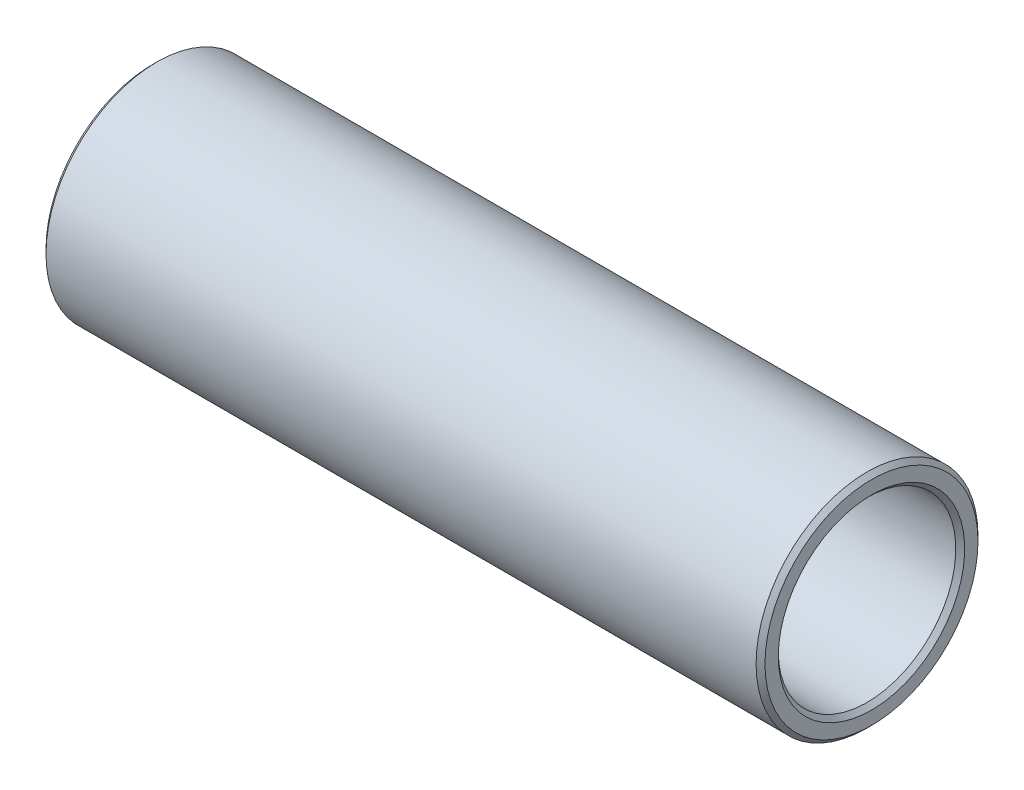
ISO-10303-21;
HEADER;
FILE_DESCRIPTION(('STEP AP214'),'2;1');
FILE_NAME('part.step','',(''),(''),'','','');
FILE_SCHEMA(('AUTOMOTIVE_DESIGN { 1 0 10303 214 1 1 1 1 }'));
ENDSEC;
DATA;
#1=APPLICATION_CONTEXT('core data for automotive mechanical design processes');
#2=APPLICATION_PROTOCOL_DEFINITION('international standard','automotive_design',2000,#1);
#3=PRODUCT_CONTEXT('',#1,'mechanical');
#4=PRODUCT('Part','Part','',(#3));
#5=PRODUCT_RELATED_PRODUCT_CATEGORY('part','',(#4));
#6=PRODUCT_DEFINITION_FORMATION('','',#4);
#7=PRODUCT_DEFINITION_CONTEXT('part definition',#1,'design');
#8=PRODUCT_DEFINITION('design','',#6,#7);
#9=PRODUCT_DEFINITION_SHAPE('','',#8);
#10=(LENGTH_UNIT() NAMED_UNIT(*) SI_UNIT(.MILLI.,.METRE.));
#11=(NAMED_UNIT(*) PLANE_ANGLE_UNIT() SI_UNIT($,.RADIAN.));
#12=(NAMED_UNIT(*) SI_UNIT($,.STERADIAN.) SOLID_ANGLE_UNIT());
#13=UNCERTAINTY_MEASURE_WITH_UNIT(LENGTH_MEASURE(1.E-05),#10,'distance_accuracy_value','');
#14=(GEOMETRIC_REPRESENTATION_CONTEXT(3) GLOBAL_UNCERTAINTY_ASSIGNED_CONTEXT((#13)) GLOBAL_UNIT_ASSIGNED_CONTEXT((#10,
#11,#12)) REPRESENTATION_CONTEXT('',''));
#15=CARTESIAN_POINT('',(0.,0.,0.));
#16=DIRECTION('',(0.,0.,1.));
#17=DIRECTION('',(1.,0.,0.));
#18=AXIS2_PLACEMENT_3D('',#15,#16,#17);
#19=CARTESIAN_POINT('',(0.,0.,0.));
#20=DIRECTION('',(-1.,0.,0.));
#21=DIRECTION('',(0.,0.,1.));
#22=AXIS2_PLACEMENT_3D('',#19,#20,#21);
#23=CYLINDRICAL_SURFACE('',#22,12.5);
#24=CARTESIAN_POINT('',(0.5,0.,0.));
#25=DIRECTION('',(1.,0.,0.));
#26=DIRECTION('',(0.,0.,-1.));
#27=AXIS2_PLACEMENT_3D('',#24,#25,#26);
#28=CIRCLE('',#27,12.5);
#29=CARTESIAN_POINT('',(0.5,0.,-12.5));
#30=VERTEX_POINT('',#29);
#31=EDGE_CURVE('E70',#30,#30,#28,.T.);
#32=ORIENTED_EDGE('',*,*,#31,.T.);
#33=EDGE_LOOP('',(#32));
#34=FACE_BOUND('',#33,.T.);
#35=CARTESIAN_POINT('',(80.5,0.,0.));
#36=DIRECTION('',(-1.,0.,0.));
#37=DIRECTION('',(0.,0.,1.));
#38=AXIS2_PLACEMENT_3D('',#35,#36,#37);
#39=CIRCLE('',#38,12.5);
#40=CARTESIAN_POINT('',(80.5,0.,12.5));
#41=VERTEX_POINT('',#40);
#42=EDGE_CURVE('E74',#41,#41,#39,.T.);
#43=ORIENTED_EDGE('',*,*,#42,.T.);
#44=EDGE_LOOP('',(#43));
#45=FACE_BOUND('',#44,.T.);
#46=ADVANCED_FACE('F45',(#34,#45),#23,.T.);
#47=CARTESIAN_POINT('',(0.,12.5,0.));
#48=DIRECTION('',(1.,0.,0.));
#49=DIRECTION('',(0.,0.,-1.));
#50=AXIS2_PLACEMENT_3D('',#47,#48,#49);
#51=PLANE('',#50);
#52=CARTESIAN_POINT('',(0.,0.,0.));
#53=DIRECTION('',(1.,0.,0.));
#54=DIRECTION('',(0.,0.,-1.));
#55=AXIS2_PLACEMENT_3D('',#52,#53,#54);
#56=CIRCLE('',#55,12.);
#57=CARTESIAN_POINT('',(0.,0.,-12.));
#58=VERTEX_POINT('',#57);
#59=EDGE_CURVE('E78',#58,#58,#56,.F.);
#60=ORIENTED_EDGE('',*,*,#59,.T.);
#61=EDGE_LOOP('',(#60));
#62=FACE_BOUND('',#61,.T.);
#63=CARTESIAN_POINT('',(0.,0.,0.));
#64=DIRECTION('',(1.,0.,0.));
#65=DIRECTION('',(0.,0.,-1.));
#66=AXIS2_PLACEMENT_3D('',#63,#64,#65);
#67=CIRCLE('',#66,10.5);
#68=CARTESIAN_POINT('',(0.,0.,-10.5));
#69=VERTEX_POINT('',#68);
#70=EDGE_CURVE('E82',#69,#69,#67,.T.);
#71=ORIENTED_EDGE('',*,*,#70,.T.);
#72=EDGE_LOOP('',(#71));
#73=FACE_BOUND('',#72,.T.);
#74=ADVANCED_FACE('F87',(#62,#73),#51,.F.);
#75=CARTESIAN_POINT('',(0.,0.,0.));
#76=DIRECTION('',(-1.,0.,0.));
#77=DIRECTION('',(0.,0.,1.));
#78=AXIS2_PLACEMENT_3D('',#75,#76,#77);
#79=CYLINDRICAL_SURFACE('',#78,10.);
#80=CARTESIAN_POINT('',(0.500000000000002,0.,0.));
#81=DIRECTION('',(1.,0.,0.));
#82=DIRECTION('',(0.,0.,-1.));
#83=AXIS2_PLACEMENT_3D('',#80,#81,#82);
#84=CIRCLE('',#83,10.);
#85=CARTESIAN_POINT('',(0.500000000000002,0.,-10.));
#86=VERTEX_POINT('',#85);
#87=EDGE_CURVE('E59',#86,#86,#84,.F.);
#88=ORIENTED_EDGE('',*,*,#87,.T.);
#89=EDGE_LOOP('',(#88));
#90=FACE_BOUND('',#89,.T.);
#91=CARTESIAN_POINT('',(80.5,0.,0.));
#92=DIRECTION('',(-1.,0.,0.));
#93=DIRECTION('',(0.,0.,1.));
#94=AXIS2_PLACEMENT_3D('',#91,#92,#93);
#95=CIRCLE('',#94,10.);
#96=CARTESIAN_POINT('',(80.5,0.,10.));
#97=VERTEX_POINT('',#96);
#98=EDGE_CURVE('E64',#97,#97,#95,.F.);
#99=ORIENTED_EDGE('',*,*,#98,.T.);
#100=EDGE_LOOP('',(#99));
#101=FACE_BOUND('',#100,.T.);
#102=ADVANCED_FACE('F97',(#90,#101),#79,.F.);
#103=CARTESIAN_POINT('',(81.,10.,0.));
#104=DIRECTION('',(-1.,0.,0.));
#105=DIRECTION('',(0.,0.,1.));
#106=AXIS2_PLACEMENT_3D('',#103,#104,#105);
#107=PLANE('',#106);
#108=CARTESIAN_POINT('',(81.,0.,0.));
#109=DIRECTION('',(-1.,0.,0.));
#110=DIRECTION('',(0.,0.,1.));
#111=AXIS2_PLACEMENT_3D('',#108,#109,#110);
#112=CIRCLE('',#111,10.5);
#113=CARTESIAN_POINT('',(81.,0.,10.5));
#114=VERTEX_POINT('',#113);
#115=EDGE_CURVE('E10',#114,#114,#112,.T.);
#116=ORIENTED_EDGE('',*,*,#115,.T.);
#117=EDGE_LOOP('',(#116));
#118=FACE_BOUND('',#117,.T.);
#119=CARTESIAN_POINT('',(81.,0.,0.));
#120=DIRECTION('',(-1.,0.,0.));
#121=DIRECTION('',(0.,0.,1.));
#122=AXIS2_PLACEMENT_3D('',#119,#120,#121);
#123=CIRCLE('',#122,12.);
#124=CARTESIAN_POINT('',(81.,0.,12.));
#125=VERTEX_POINT('',#124);
#126=EDGE_CURVE('E54',#125,#125,#123,.F.);
#127=ORIENTED_EDGE('',*,*,#126,.T.);
#128=EDGE_LOOP('',(#127));
#129=FACE_BOUND('',#128,.T.);
#130=ADVANCED_FACE('F100',(#118,#129),#107,.F.);
#131=CARTESIAN_POINT('',(0.,0.,0.));
#132=DIRECTION('',(1.,0.,0.));
#133=DIRECTION('',(0.,0.,-1.));
#134=AXIS2_PLACEMENT_3D('',#131,#132,#133);
#135=CONICAL_SURFACE('',#134,12.,0.785398163397447);
#136=ORIENTED_EDGE('',*,*,#31,.F.);
#137=EDGE_LOOP('',(#136));
#138=FACE_BOUND('',#137,.T.);
#139=ORIENTED_EDGE('',*,*,#59,.F.);
#140=EDGE_LOOP('',(#139));
#141=FACE_BOUND('',#140,.T.);
#142=ADVANCED_FACE('F93',(#138,#141),#135,.T.);
#143=CARTESIAN_POINT('',(0.500000000000002,0.,0.));
#144=DIRECTION('',(-1.,0.,0.));
#145=DIRECTION('',(0.,0.,1.));
#146=AXIS2_PLACEMENT_3D('',#143,#144,#145);
#147=CONICAL_SURFACE('',#146,10.,0.785398163397462);
#148=ORIENTED_EDGE('',*,*,#70,.F.);
#149=EDGE_LOOP('',(#148));
#150=FACE_BOUND('',#149,.T.);
#151=ORIENTED_EDGE('',*,*,#87,.F.);
#152=EDGE_LOOP('',(#151));
#153=FACE_BOUND('',#152,.T.);
#154=ADVANCED_FACE('F89',(#150,#153),#147,.F.);
#155=CARTESIAN_POINT('',(81.,0.,0.));
#156=DIRECTION('',(1.,0.,0.));
#157=DIRECTION('',(0.,0.,-1.));
#158=AXIS2_PLACEMENT_3D('',#155,#156,#157);
#159=CONICAL_SURFACE('',#158,10.5,0.785398163397443);
#160=ORIENTED_EDGE('',*,*,#98,.F.);
#161=EDGE_LOOP('',(#160));
#162=FACE_BOUND('',#161,.T.);
#163=ORIENTED_EDGE('',*,*,#115,.F.);
#164=EDGE_LOOP('',(#163));
#165=FACE_BOUND('',#164,.T.);
#166=ADVANCED_FACE('F92',(#162,#165),#159,.F.);
#167=CARTESIAN_POINT('',(80.5,0.,0.));
#168=DIRECTION('',(-1.,0.,0.));
#169=DIRECTION('',(0.,0.,1.));
#170=AXIS2_PLACEMENT_3D('',#167,#168,#169);
#171=CONICAL_SURFACE('',#170,12.5,0.785398163397447);
#172=ORIENTED_EDGE('',*,*,#126,.F.);
#173=EDGE_LOOP('',(#172));
#174=FACE_BOUND('',#173,.T.);
#175=ORIENTED_EDGE('',*,*,#42,.F.);
#176=EDGE_LOOP('',(#175));
#177=FACE_BOUND('',#176,.T.);
#178=ADVANCED_FACE('F48',(#174,#177),#171,.T.);
#179=CLOSED_SHELL('',(#46,#74,#102,#130,#142,#154,#166,#178));
#180=MANIFOLD_SOLID_BREP('B2',#179);
#181=ADVANCED_BREP_SHAPE_REPRESENTATION('',(#18,#180),#14);
#182=SHAPE_DEFINITION_REPRESENTATION(#9,#181);
ENDSEC;
END-ISO-10303-21;
